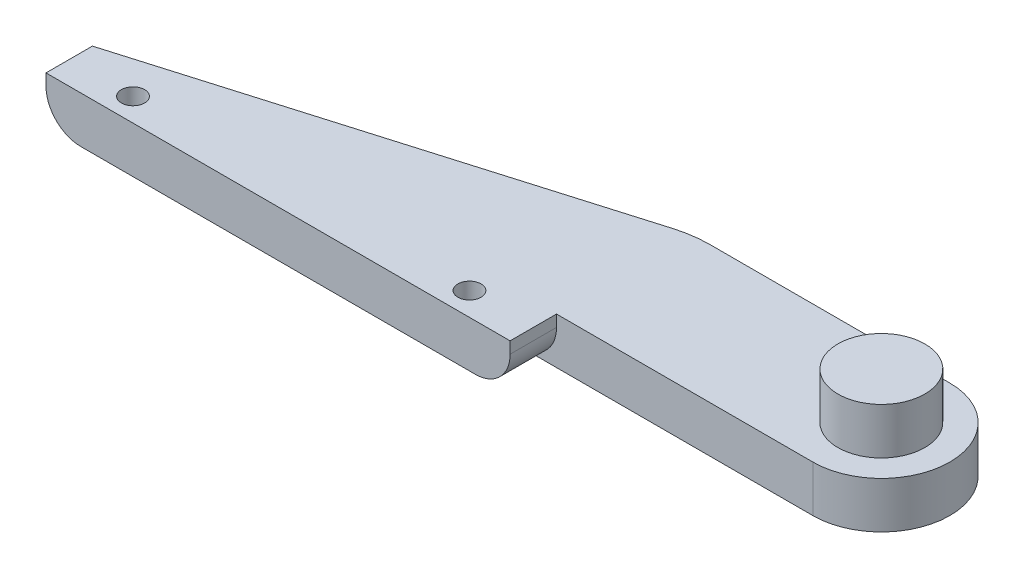
ISO-10303-21;
HEADER;
FILE_DESCRIPTION(('STEP AP214'),'2;1');
FILE_NAME('part.step','',(''),(''),'','','');
FILE_SCHEMA(('AUTOMOTIVE_DESIGN { 1 0 10303 214 1 1 1 1 }'));
ENDSEC;
DATA;
#1=APPLICATION_CONTEXT('core data for automotive mechanical design processes');
#2=APPLICATION_PROTOCOL_DEFINITION('international standard','automotive_design',2000,#1);
#3=PRODUCT_CONTEXT('',#1,'mechanical');
#4=PRODUCT('Part','Part','',(#3));
#5=PRODUCT_RELATED_PRODUCT_CATEGORY('part','',(#4));
#6=PRODUCT_DEFINITION_FORMATION('','',#4);
#7=PRODUCT_DEFINITION_CONTEXT('part definition',#1,'design');
#8=PRODUCT_DEFINITION('design','',#6,#7);
#9=PRODUCT_DEFINITION_SHAPE('','',#8);
#10=(LENGTH_UNIT() NAMED_UNIT(*) SI_UNIT(.MILLI.,.METRE.));
#11=(NAMED_UNIT(*) PLANE_ANGLE_UNIT() SI_UNIT($,.RADIAN.));
#12=(NAMED_UNIT(*) SI_UNIT($,.STERADIAN.) SOLID_ANGLE_UNIT());
#13=UNCERTAINTY_MEASURE_WITH_UNIT(LENGTH_MEASURE(1.E-05),#10,'distance_accuracy_value','');
#14=(GEOMETRIC_REPRESENTATION_CONTEXT(3) GLOBAL_UNCERTAINTY_ASSIGNED_CONTEXT((#13)) GLOBAL_UNIT_ASSIGNED_CONTEXT((#10,
#11,#12)) REPRESENTATION_CONTEXT('',''));
#15=CARTESIAN_POINT('',(0.,0.,0.));
#16=DIRECTION('',(0.,0.,1.));
#17=DIRECTION('',(1.,0.,0.));
#18=AXIS2_PLACEMENT_3D('',#15,#16,#17);
#19=CARTESIAN_POINT('',(20.,4.,-2.));
#20=DIRECTION('',(0.,0.,-1.));
#21=DIRECTION('',(-1.,0.,0.));
#22=AXIS2_PLACEMENT_3D('',#19,#20,#21);
#23=PLANE('',#22);
#24=DIRECTION('',(1.,0.,0.));
#25=VECTOR('',#24,1.);
#26=CARTESIAN_POINT('',(20.,0.,-2.));
#27=LINE('',#26,#25);
#28=CARTESIAN_POINT('',(17.,0.,-2.));
#29=VERTEX_POINT('',#28);
#30=CARTESIAN_POINT('',(42.1,0.,-2.));
#31=VERTEX_POINT('',#30);
#32=EDGE_CURVE('E54',#29,#31,#27,.T.);
#33=ORIENTED_EDGE('',*,*,#32,.T.);
#34=DIRECTION('',(0.,-1.,0.));
#35=VECTOR('',#34,1.);
#36=CARTESIAN_POINT('',(42.1,4.,-2.));
#37=LINE('',#36,#35);
#38=CARTESIAN_POINT('',(42.1,4.,-2.));
#39=VERTEX_POINT('',#38);
#40=EDGE_CURVE('E113',#39,#31,#37,.T.);
#41=ORIENTED_EDGE('',*,*,#40,.F.);
#42=DIRECTION('',(1.,0.,0.));
#43=VECTOR('',#42,1.);
#44=CARTESIAN_POINT('',(20.,4.,-2.));
#45=LINE('',#44,#43);
#46=CARTESIAN_POINT('',(20.,4.,-2.));
#47=VERTEX_POINT('',#46);
#48=EDGE_CURVE('E120',#47,#39,#45,.T.);
#49=ORIENTED_EDGE('',*,*,#48,.F.);
#50=DIRECTION('',(0.,-1.,0.));
#51=VECTOR('',#50,1.);
#52=CARTESIAN_POINT('',(20.,4.,-2.));
#53=LINE('',#52,#51);
#54=CARTESIAN_POINT('',(20.,3.,-2.));
#55=VERTEX_POINT('',#54);
#56=EDGE_CURVE('E160',#47,#55,#53,.T.);
#57=ORIENTED_EDGE('',*,*,#56,.T.);
#58=CARTESIAN_POINT('',(17.,3.,-2.));
#59=DIRECTION('',(0.,0.,-1.));
#60=DIRECTION('',(-1.,0.,0.));
#61=AXIS2_PLACEMENT_3D('',#58,#59,#60);
#62=CIRCLE('',#61,3.);
#63=EDGE_CURVE('E11',#55,#29,#62,.T.);
#64=ORIENTED_EDGE('',*,*,#63,.T.);
#65=EDGE_LOOP('',(#33,#41,#49,#57,#64));
#66=FACE_BOUND('',#65,.T.);
#67=ADVANCED_FACE('F33',(#66),#23,.F.);
#68=CARTESIAN_POINT('',(42.1,4.,-7.9));
#69=DIRECTION('',(0.,-1.,0.));
#70=DIRECTION('',(0.,0.,-1.));
#71=AXIS2_PLACEMENT_3D('',#68,#69,#70);
#72=CYLINDRICAL_SURFACE('',#71,5.9);
#73=CARTESIAN_POINT('',(42.1,0.,-7.9));
#74=DIRECTION('',(0.,1.,0.));
#75=DIRECTION('',(0.,0.,-1.));
#76=AXIS2_PLACEMENT_3D('',#73,#74,#75);
#77=CIRCLE('',#76,5.9);
#78=CARTESIAN_POINT('',(42.1,0.,-13.8));
#79=VERTEX_POINT('',#78);
#80=EDGE_CURVE('E198',#31,#79,#77,.T.);
#81=ORIENTED_EDGE('',*,*,#80,.T.);
#82=DIRECTION('',(0.,-1.,0.));
#83=VECTOR('',#82,1.);
#84=CARTESIAN_POINT('',(42.1,4.,-13.8));
#85=LINE('',#84,#83);
#86=CARTESIAN_POINT('',(42.1,4.,-13.8));
#87=VERTEX_POINT('',#86);
#88=EDGE_CURVE('E115',#87,#79,#85,.T.);
#89=ORIENTED_EDGE('',*,*,#88,.F.);
#90=CARTESIAN_POINT('',(42.1,4.,-7.9));
#91=DIRECTION('',(0.,1.,0.));
#92=DIRECTION('',(0.,0.,-1.));
#93=AXIS2_PLACEMENT_3D('',#90,#91,#92);
#94=CIRCLE('',#93,5.9);
#95=EDGE_CURVE('E109',#39,#87,#94,.T.);
#96=ORIENTED_EDGE('',*,*,#95,.F.);
#97=ORIENTED_EDGE('',*,*,#40,.T.);
#98=EDGE_LOOP('',(#81,#89,#96,#97));
#99=FACE_BOUND('',#98,.T.);
#100=ADVANCED_FACE('F111',(#99),#72,.T.);
#101=CARTESIAN_POINT('',(20.,4.,-13.8));
#102=DIRECTION('',(0.,0.,1.));
#103=DIRECTION('',(1.,0.,0.));
#104=AXIS2_PLACEMENT_3D('',#101,#102,#103);
#105=PLANE('',#104);
#106=DIRECTION('',(-1.,0.,0.));
#107=VECTOR('',#106,1.);
#108=CARTESIAN_POINT('',(20.,0.,-13.8));
#109=LINE('',#108,#107);
#110=CARTESIAN_POINT('',(21.4442342640121,0.,-13.8));
#111=VERTEX_POINT('',#110);
#112=EDGE_CURVE('E196',#79,#111,#109,.T.);
#113=ORIENTED_EDGE('',*,*,#112,.T.);
#114=DIRECTION('',(0.,-1.,0.));
#115=VECTOR('',#114,1.);
#116=CARTESIAN_POINT('',(21.4442342640121,4.,-13.8));
#117=LINE('',#116,#115);
#118=CARTESIAN_POINT('',(21.4442342640121,4.,-13.8));
#119=VERTEX_POINT('',#118);
#120=EDGE_CURVE('E141',#111,#119,#117,.F.);
#121=ORIENTED_EDGE('',*,*,#120,.T.);
#122=DIRECTION('',(-1.,0.,0.));
#123=VECTOR('',#122,1.);
#124=CARTESIAN_POINT('',(20.,4.,-13.8));
#125=LINE('',#124,#123);
#126=EDGE_CURVE('E119',#87,#119,#125,.T.);
#127=ORIENTED_EDGE('',*,*,#126,.F.);
#128=ORIENTED_EDGE('',*,*,#88,.T.);
#129=EDGE_LOOP('',(#113,#121,#127,#128));
#130=FACE_BOUND('',#129,.T.);
#131=ADVANCED_FACE('F262',(#130),#105,.F.);
#132=CARTESIAN_POINT('',(-20.,4.,-2.));
#133=DIRECTION('',(0.282945147243684,0.,0.959136092351471));
#134=DIRECTION('',(0.959136092351471,0.,-0.282945147243684));
#135=AXIS2_PLACEMENT_3D('',#132,#133,#134);
#136=PLANE('',#135);
#137=DIRECTION('',(-0.959136092351471,0.,0.282945147243684));
#138=VECTOR('',#137,1.);
#139=CARTESIAN_POINT('',(-20.,0.,-2.));
#140=LINE('',#139,#138);
#141=CARTESIAN_POINT('',(18.6147827915753,0.,-13.3913609235147));
#142=VERTEX_POINT('',#141);
#143=CARTESIAN_POINT('',(-17.,0.,-2.885));
#144=VERTEX_POINT('',#143);
#145=EDGE_CURVE('E195',#142,#144,#140,.T.);
#146=ORIENTED_EDGE('',*,*,#145,.T.);
#147=CARTESIAN_POINT('',(-17.,3.,-2.885));
#148=DIRECTION('',(0.282945147243684,0.,0.959136092351471));
#149=DIRECTION('',(0.959136092351471,0.,-0.282945147243684));
#150=AXIS2_PLACEMENT_3D('',#147,#148,#149);
#151=ELLIPSE('',#150,3.12781473236507,3.);
#152=CARTESIAN_POINT('',(-20.,3.,-2.));
#153=VERTEX_POINT('',#152);
#154=EDGE_CURVE('E156',#144,#153,#151,.F.);
#155=ORIENTED_EDGE('',*,*,#154,.T.);
#156=DIRECTION('',(0.,-1.,0.));
#157=VECTOR('',#156,1.);
#158=CARTESIAN_POINT('',(-20.,4.,-2.));
#159=LINE('',#158,#157);
#160=CARTESIAN_POINT('',(-20.,4.,-2.));
#161=VERTEX_POINT('',#160);
#162=EDGE_CURVE('E136',#161,#153,#159,.T.);
#163=ORIENTED_EDGE('',*,*,#162,.F.);
#164=DIRECTION('',(-0.959136092351471,0.,0.282945147243684));
#165=VECTOR('',#164,1.);
#166=CARTESIAN_POINT('',(-20.,4.,-2.));
#167=LINE('',#166,#165);
#168=CARTESIAN_POINT('',(18.6147827915753,4.,-13.3913609235147));
#169=VERTEX_POINT('',#168);
#170=EDGE_CURVE('E206',#169,#161,#167,.T.);
#171=ORIENTED_EDGE('',*,*,#170,.F.);
#172=DIRECTION('',(0.,-1.,0.));
#173=VECTOR('',#172,1.);
#174=CARTESIAN_POINT('',(18.6147827915753,4.,-13.3913609235147));
#175=LINE('',#174,#173);
#176=EDGE_CURVE('E131',#169,#142,#175,.T.);
#177=ORIENTED_EDGE('',*,*,#176,.T.);
#178=EDGE_LOOP('',(#146,#155,#163,#171,#177));
#179=FACE_BOUND('',#178,.T.);
#180=ADVANCED_FACE('F277',(#179),#136,.F.);
#181=CARTESIAN_POINT('',(-20.,4.,2.));
#182=DIRECTION('',(1.,0.,0.));
#183=DIRECTION('',(0.,0.,-1.));
#184=AXIS2_PLACEMENT_3D('',#181,#182,#183);
#185=PLANE('',#184);
#186=ORIENTED_EDGE('',*,*,#162,.T.);
#187=DIRECTION('',(0.,0.,1.));
#188=VECTOR('',#187,1.);
#189=CARTESIAN_POINT('',(-20.,3.,2.));
#190=LINE('',#189,#188);
#191=CARTESIAN_POINT('',(-20.,3.,2.));
#192=VERTEX_POINT('',#191);
#193=EDGE_CURVE('E145',#153,#192,#190,.T.);
#194=ORIENTED_EDGE('',*,*,#193,.T.);
#195=DIRECTION('',(0.,-1.,0.));
#196=VECTOR('',#195,1.);
#197=CARTESIAN_POINT('',(-20.,4.,2.));
#198=LINE('',#197,#196);
#199=CARTESIAN_POINT('',(-20.,4.,2.));
#200=VERTEX_POINT('',#199);
#201=EDGE_CURVE('E165',#200,#192,#198,.T.);
#202=ORIENTED_EDGE('',*,*,#201,.F.);
#203=DIRECTION('',(0.,0.,1.));
#204=VECTOR('',#203,1.);
#205=CARTESIAN_POINT('',(-20.,4.,2.));
#206=LINE('',#205,#204);
#207=EDGE_CURVE('E180',#161,#200,#206,.T.);
#208=ORIENTED_EDGE('',*,*,#207,.F.);
#209=EDGE_LOOP('',(#186,#194,#202,#208));
#210=FACE_BOUND('',#209,.T.);
#211=ADVANCED_FACE('F178',(#210),#185,.F.);
#212=CARTESIAN_POINT('',(-20.,4.,2.));
#213=DIRECTION('',(0.,0.,-1.));
#214=DIRECTION('',(-1.,0.,0.));
#215=AXIS2_PLACEMENT_3D('',#212,#213,#214);
#216=PLANE('',#215);
#217=ORIENTED_EDGE('',*,*,#201,.T.);
#218=CARTESIAN_POINT('',(-17.,3.,2.));
#219=DIRECTION('',(0.,0.,-1.));
#220=DIRECTION('',(-1.,0.,0.));
#221=AXIS2_PLACEMENT_3D('',#218,#219,#220);
#222=CIRCLE('',#221,3.);
#223=CARTESIAN_POINT('',(-17.,0.,2.));
#224=VERTEX_POINT('',#223);
#225=EDGE_CURVE('E150',#192,#224,#222,.F.);
#226=ORIENTED_EDGE('',*,*,#225,.T.);
#227=DIRECTION('',(1.,0.,0.));
#228=VECTOR('',#227,1.);
#229=CARTESIAN_POINT('',(-20.,0.,2.));
#230=LINE('',#229,#228);
#231=CARTESIAN_POINT('',(17.,0.,2.));
#232=VERTEX_POINT('',#231);
#233=EDGE_CURVE('E129',#224,#232,#230,.T.);
#234=ORIENTED_EDGE('',*,*,#233,.T.);
#235=CARTESIAN_POINT('',(17.,3.,2.));
#236=DIRECTION('',(0.,0.,-1.));
#237=DIRECTION('',(-1.,0.,0.));
#238=AXIS2_PLACEMENT_3D('',#235,#236,#237);
#239=CIRCLE('',#238,3.);
#240=CARTESIAN_POINT('',(20.,3.,2.));
#241=VERTEX_POINT('',#240);
#242=EDGE_CURVE('E148',#232,#241,#239,.F.);
#243=ORIENTED_EDGE('',*,*,#242,.T.);
#244=DIRECTION('',(0.,-1.,0.));
#245=VECTOR('',#244,1.);
#246=CARTESIAN_POINT('',(20.,4.,2.));
#247=LINE('',#246,#245);
#248=CARTESIAN_POINT('',(20.,4.,2.));
#249=VERTEX_POINT('',#248);
#250=EDGE_CURVE('E162',#249,#241,#247,.T.);
#251=ORIENTED_EDGE('',*,*,#250,.F.);
#252=DIRECTION('',(1.,0.,0.));
#253=VECTOR('',#252,1.);
#254=CARTESIAN_POINT('',(-20.,4.,2.));
#255=LINE('',#254,#253);
#256=EDGE_CURVE('E167',#200,#249,#255,.T.);
#257=ORIENTED_EDGE('',*,*,#256,.F.);
#258=EDGE_LOOP('',(#217,#226,#234,#243,#251,#257));
#259=FACE_BOUND('',#258,.T.);
#260=ADVANCED_FACE('F190',(#259),#216,.F.);
#261=CARTESIAN_POINT('',(20.,4.,2.));
#262=DIRECTION('',(-1.,0.,0.));
#263=DIRECTION('',(0.,0.,1.));
#264=AXIS2_PLACEMENT_3D('',#261,#262,#263);
#265=PLANE('',#264);
#266=ORIENTED_EDGE('',*,*,#250,.T.);
#267=DIRECTION('',(0.,0.,-1.));
#268=VECTOR('',#267,1.);
#269=CARTESIAN_POINT('',(20.,3.,-2.));
#270=LINE('',#269,#268);
#271=EDGE_CURVE('E41',#241,#55,#270,.T.);
#272=ORIENTED_EDGE('',*,*,#271,.T.);
#273=ORIENTED_EDGE('',*,*,#56,.F.);
#274=DIRECTION('',(0.,0.,-1.));
#275=VECTOR('',#274,1.);
#276=CARTESIAN_POINT('',(20.,4.,2.));
#277=LINE('',#276,#275);
#278=EDGE_CURVE('E125',#249,#47,#277,.T.);
#279=ORIENTED_EDGE('',*,*,#278,.F.);
#280=EDGE_LOOP('',(#266,#272,#273,#279));
#281=FACE_BOUND('',#280,.T.);
#282=ADVANCED_FACE('F159',(#281),#265,.F.);
#283=CARTESIAN_POINT('',(42.1,4.,-7.9));
#284=DIRECTION('',(0.,-1.,0.));
#285=DIRECTION('',(0.,0.,-1.));
#286=AXIS2_PLACEMENT_3D('',#283,#284,#285);
#287=PLANE('',#286);
#288=CARTESIAN_POINT('',(14.5,4.,0.));
#289=DIRECTION('',(0.,-1.,0.));
#290=DIRECTION('',(0.,0.,-1.));
#291=AXIS2_PLACEMENT_3D('',#288,#289,#290);
#292=CIRCLE('',#291,1.);
#293=CARTESIAN_POINT('',(14.5,4.,-1.));
#294=VERTEX_POINT('',#293);
#295=EDGE_CURVE('E220',#294,#294,#292,.T.);
#296=ORIENTED_EDGE('',*,*,#295,.T.);
#297=EDGE_LOOP('',(#296));
#298=FACE_BOUND('',#297,.T.);
#299=CARTESIAN_POINT('',(-14.5,4.,0.));
#300=DIRECTION('',(0.,-1.,0.));
#301=DIRECTION('',(0.,0.,-1.));
#302=AXIS2_PLACEMENT_3D('',#299,#300,#301);
#303=CIRCLE('',#302,1.);
#304=CARTESIAN_POINT('',(-14.5,4.,-1.));
#305=VERTEX_POINT('',#304);
#306=EDGE_CURVE('E212',#305,#305,#303,.T.);
#307=ORIENTED_EDGE('',*,*,#306,.T.);
#308=EDGE_LOOP('',(#307));
#309=FACE_BOUND('',#308,.T.);
#310=CARTESIAN_POINT('',(42.1,4.,-7.9));
#311=DIRECTION('',(0.,-1.,0.));
#312=DIRECTION('',(0.,0.,-1.));
#313=AXIS2_PLACEMENT_3D('',#310,#311,#312);
#314=CIRCLE('',#313,3.74618150465741);
#315=CARTESIAN_POINT('',(42.1,4.,-11.6461815046574));
#316=VERTEX_POINT('',#315);
#317=EDGE_CURVE('E209',#316,#316,#314,.T.);
#318=ORIENTED_EDGE('',*,*,#317,.T.);
#319=EDGE_LOOP('',(#318));
#320=FACE_BOUND('',#319,.T.);
#321=ORIENTED_EDGE('',*,*,#126,.T.);
#322=CARTESIAN_POINT('',(21.4442342640121,4.,-3.8));
#323=DIRECTION('',(0.,-1.,0.));
#324=DIRECTION('',(0.,0.,-1.));
#325=AXIS2_PLACEMENT_3D('',#322,#323,#324);
#326=CIRCLE('',#325,10.);
#327=EDGE_CURVE('E143',#119,#169,#326,.F.);
#328=ORIENTED_EDGE('',*,*,#327,.T.);
#329=ORIENTED_EDGE('',*,*,#170,.T.);
#330=ORIENTED_EDGE('',*,*,#207,.T.);
#331=ORIENTED_EDGE('',*,*,#256,.T.);
#332=ORIENTED_EDGE('',*,*,#278,.T.);
#333=ORIENTED_EDGE('',*,*,#48,.T.);
#334=ORIENTED_EDGE('',*,*,#95,.T.);
#335=EDGE_LOOP('',(#321,#328,#329,#330,#331,#332,#333,#334));
#336=FACE_BOUND('',#335,.T.);
#337=ADVANCED_FACE('F123',(#298,#309,#320,#336),#287,.F.);
#338=CARTESIAN_POINT('',(42.1,0.,-7.9));
#339=DIRECTION('',(0.,-1.,0.));
#340=DIRECTION('',(0.,0.,-1.));
#341=AXIS2_PLACEMENT_3D('',#338,#339,#340);
#342=PLANE('',#341);
#343=CARTESIAN_POINT('',(14.5,0.,0.));
#344=DIRECTION('',(0.,-1.,0.));
#345=DIRECTION('',(0.,0.,-1.));
#346=AXIS2_PLACEMENT_3D('',#343,#344,#345);
#347=CIRCLE('',#346,1.);
#348=CARTESIAN_POINT('',(14.5,0.,-1.));
#349=VERTEX_POINT('',#348);
#350=EDGE_CURVE('E223',#349,#349,#347,.T.);
#351=ORIENTED_EDGE('',*,*,#350,.F.);
#352=EDGE_LOOP('',(#351));
#353=FACE_BOUND('',#352,.T.);
#354=CARTESIAN_POINT('',(-14.5,0.,0.));
#355=DIRECTION('',(0.,-1.,0.));
#356=DIRECTION('',(0.,0.,-1.));
#357=AXIS2_PLACEMENT_3D('',#354,#355,#356);
#358=CIRCLE('',#357,1.);
#359=CARTESIAN_POINT('',(-14.5,0.,-1.));
#360=VERTEX_POINT('',#359);
#361=EDGE_CURVE('E217',#360,#360,#358,.T.);
#362=ORIENTED_EDGE('',*,*,#361,.F.);
#363=EDGE_LOOP('',(#362));
#364=FACE_BOUND('',#363,.T.);
#365=ORIENTED_EDGE('',*,*,#233,.F.);
#366=DIRECTION('',(0.,0.,1.));
#367=VECTOR('',#366,1.);
#368=CARTESIAN_POINT('',(-17.,0.,-2.));
#369=LINE('',#368,#367);
#370=EDGE_CURVE('E154',#224,#144,#369,.F.);
#371=ORIENTED_EDGE('',*,*,#370,.T.);
#372=ORIENTED_EDGE('',*,*,#145,.F.);
#373=CARTESIAN_POINT('',(21.4442342640121,0.,-3.8));
#374=DIRECTION('',(0.,-1.,0.));
#375=DIRECTION('',(0.,0.,-1.));
#376=AXIS2_PLACEMENT_3D('',#373,#374,#375);
#377=CIRCLE('',#376,10.);
#378=EDGE_CURVE('E134',#142,#111,#377,.T.);
#379=ORIENTED_EDGE('',*,*,#378,.T.);
#380=ORIENTED_EDGE('',*,*,#112,.F.);
#381=ORIENTED_EDGE('',*,*,#80,.F.);
#382=ORIENTED_EDGE('',*,*,#32,.F.);
#383=DIRECTION('',(0.,0.,-1.));
#384=VECTOR('',#383,1.);
#385=CARTESIAN_POINT('',(17.,0.,2.));
#386=LINE('',#385,#384);
#387=EDGE_CURVE('E152',#29,#232,#386,.F.);
#388=ORIENTED_EDGE('',*,*,#387,.T.);
#389=EDGE_LOOP('',(#365,#371,#372,#379,#380,#381,#382,#388));
#390=FACE_BOUND('',#389,.T.);
#391=ADVANCED_FACE('F192',(#353,#364,#390),#342,.T.);
#392=CARTESIAN_POINT('',(42.1,8.,-7.9));
#393=DIRECTION('',(0.,-1.,0.));
#394=DIRECTION('',(0.,0.,-1.));
#395=AXIS2_PLACEMENT_3D('',#392,#393,#394);
#396=CYLINDRICAL_SURFACE('',#395,3.74618150465741);
#397=CARTESIAN_POINT('',(42.1,8.,-7.9));
#398=DIRECTION('',(0.,-1.,0.));
#399=DIRECTION('',(0.,0.,-1.));
#400=AXIS2_PLACEMENT_3D('',#397,#398,#399);
#401=CIRCLE('',#400,3.74618150465741);
#402=CARTESIAN_POINT('',(42.1,8.,-11.6461815046574));
#403=VERTEX_POINT('',#402);
#404=EDGE_CURVE('E202',#403,#403,#401,.T.);
#405=ORIENTED_EDGE('',*,*,#404,.T.);
#406=EDGE_LOOP('',(#405));
#407=FACE_BOUND('',#406,.T.);
#408=ORIENTED_EDGE('',*,*,#317,.F.);
#409=EDGE_LOOP('',(#408));
#410=FACE_BOUND('',#409,.T.);
#411=ADVANCED_FACE('F232',(#407,#410),#396,.T.);
#412=CARTESIAN_POINT('',(42.1,8.,-7.9));
#413=DIRECTION('',(0.,-1.,0.));
#414=DIRECTION('',(0.,0.,-1.));
#415=AXIS2_PLACEMENT_3D('',#412,#413,#414);
#416=PLANE('',#415);
#417=ORIENTED_EDGE('',*,*,#404,.F.);
#418=EDGE_LOOP('',(#417));
#419=FACE_BOUND('',#418,.T.);
#420=ADVANCED_FACE('F239',(#419),#416,.F.);
#421=CARTESIAN_POINT('',(-14.5,8.,0.));
#422=DIRECTION('',(0.,-1.,0.));
#423=DIRECTION('',(0.,0.,-1.));
#424=AXIS2_PLACEMENT_3D('',#421,#422,#423);
#425=CYLINDRICAL_SURFACE('',#424,1.);
#426=ORIENTED_EDGE('',*,*,#361,.T.);
#427=EDGE_LOOP('',(#426));
#428=FACE_BOUND('',#427,.T.);
#429=ORIENTED_EDGE('',*,*,#306,.F.);
#430=EDGE_LOOP('',(#429));
#431=FACE_BOUND('',#430,.T.);
#432=ADVANCED_FACE('F236',(#428,#431),#425,.F.);
#433=CARTESIAN_POINT('',(14.5,8.,0.));
#434=DIRECTION('',(0.,-1.,0.));
#435=DIRECTION('',(0.,0.,-1.));
#436=AXIS2_PLACEMENT_3D('',#433,#434,#435);
#437=CYLINDRICAL_SURFACE('',#436,1.);
#438=ORIENTED_EDGE('',*,*,#350,.T.);
#439=EDGE_LOOP('',(#438));
#440=FACE_BOUND('',#439,.T.);
#441=ORIENTED_EDGE('',*,*,#295,.F.);
#442=EDGE_LOOP('',(#441));
#443=FACE_BOUND('',#442,.T.);
#444=ADVANCED_FACE('F227',(#440,#443),#437,.F.);
#445=CARTESIAN_POINT('',(21.4442342640121,4.,-3.8));
#446=DIRECTION('',(0.,-1.,0.));
#447=DIRECTION('',(0.,0.,-1.));
#448=AXIS2_PLACEMENT_3D('',#445,#446,#447);
#449=CYLINDRICAL_SURFACE('',#448,10.);
#450=ORIENTED_EDGE('',*,*,#327,.F.);
#451=ORIENTED_EDGE('',*,*,#120,.F.);
#452=ORIENTED_EDGE('',*,*,#378,.F.);
#453=ORIENTED_EDGE('',*,*,#176,.F.);
#454=EDGE_LOOP('',(#450,#451,#452,#453));
#455=FACE_BOUND('',#454,.T.);
#456=ADVANCED_FACE('F266',(#455),#449,.T.);
#457=CARTESIAN_POINT('',(-17.,3.,2.));
#458=DIRECTION('',(0.,0.,-1.));
#459=DIRECTION('',(-1.,0.,0.));
#460=AXIS2_PLACEMENT_3D('',#457,#458,#459);
#461=CYLINDRICAL_SURFACE('',#460,3.);
#462=ORIENTED_EDGE('',*,*,#154,.F.);
#463=ORIENTED_EDGE('',*,*,#370,.F.);
#464=ORIENTED_EDGE('',*,*,#225,.F.);
#465=ORIENTED_EDGE('',*,*,#193,.F.);
#466=EDGE_LOOP('',(#462,#463,#464,#465));
#467=FACE_BOUND('',#466,.T.);
#468=ADVANCED_FACE('F185',(#467),#461,.T.);
#469=CARTESIAN_POINT('',(17.,3.,2.));
#470=DIRECTION('',(0.,0.,1.));
#471=DIRECTION('',(1.,0.,0.));
#472=AXIS2_PLACEMENT_3D('',#469,#470,#471);
#473=CYLINDRICAL_SURFACE('',#472,3.);
#474=ORIENTED_EDGE('',*,*,#242,.F.);
#475=ORIENTED_EDGE('',*,*,#387,.F.);
#476=ORIENTED_EDGE('',*,*,#63,.F.);
#477=ORIENTED_EDGE('',*,*,#271,.F.);
#478=EDGE_LOOP('',(#474,#475,#476,#477));
#479=FACE_BOUND('',#478,.T.);
#480=ADVANCED_FACE('F35',(#479),#473,.T.);
#481=CLOSED_SHELL('',(#67,#100,#131,#180,#211,#260,#282,#337,#391,#411,#420,#432,#444,#456,#468,#480));
#482=MANIFOLD_SOLID_BREP('B2',#481);
#483=ADVANCED_BREP_SHAPE_REPRESENTATION('',(#18,#482),#14);
#484=SHAPE_DEFINITION_REPRESENTATION(#9,#483);
ENDSEC;
END-ISO-10303-21;
